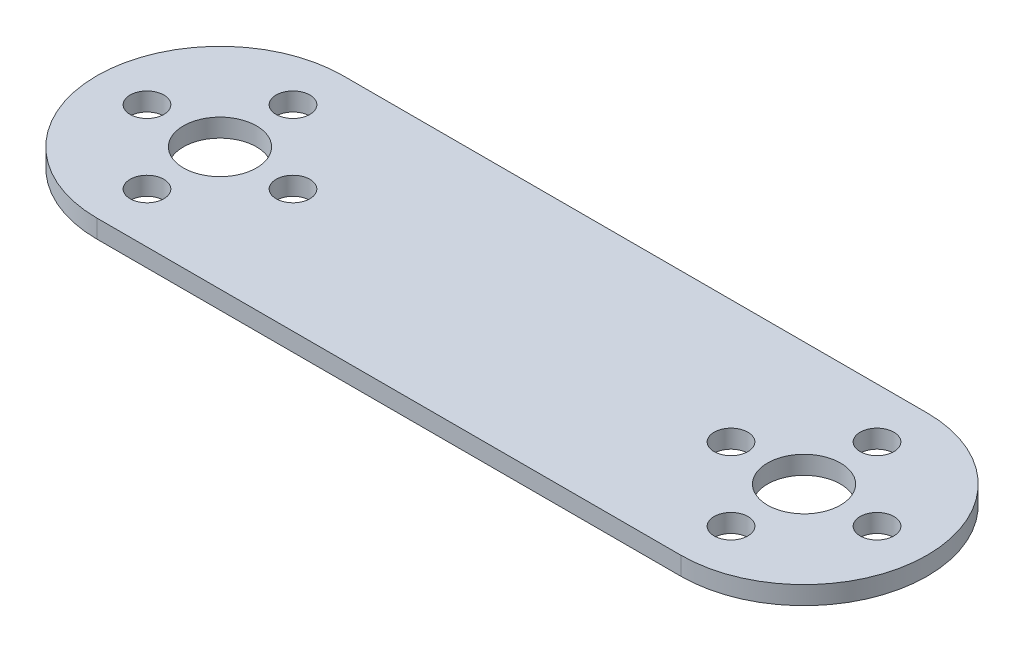
ISO-10303-21;
HEADER;
FILE_DESCRIPTION(('STEP AP214'),'2;1');
FILE_NAME('part.step','',(''),(''),'','','');
FILE_SCHEMA(('AUTOMOTIVE_DESIGN { 1 0 10303 214 1 1 1 1 }'));
ENDSEC;
DATA;
#1=APPLICATION_CONTEXT('core data for automotive mechanical design processes');
#2=APPLICATION_PROTOCOL_DEFINITION('international standard','automotive_design',2000,#1);
#3=PRODUCT_CONTEXT('',#1,'mechanical');
#4=PRODUCT('Part','Part','',(#3));
#5=PRODUCT_RELATED_PRODUCT_CATEGORY('part','',(#4));
#6=PRODUCT_DEFINITION_FORMATION('','',#4);
#7=PRODUCT_DEFINITION_CONTEXT('part definition',#1,'design');
#8=PRODUCT_DEFINITION('design','',#6,#7);
#9=PRODUCT_DEFINITION_SHAPE('','',#8);
#10=(LENGTH_UNIT() NAMED_UNIT(*) SI_UNIT(.MILLI.,.METRE.));
#11=(NAMED_UNIT(*) PLANE_ANGLE_UNIT() SI_UNIT($,.RADIAN.));
#12=(NAMED_UNIT(*) SI_UNIT($,.STERADIAN.) SOLID_ANGLE_UNIT());
#13=UNCERTAINTY_MEASURE_WITH_UNIT(LENGTH_MEASURE(1.E-05),#10,'distance_accuracy_value','');
#14=(GEOMETRIC_REPRESENTATION_CONTEXT(3) GLOBAL_UNCERTAINTY_ASSIGNED_CONTEXT((#13)) GLOBAL_UNIT_ASSIGNED_CONTEXT((#10,
#11,#12)) REPRESENTATION_CONTEXT('',''));
#15=CARTESIAN_POINT('',(0.,0.,0.));
#16=DIRECTION('',(0.,0.,1.));
#17=DIRECTION('',(1.,0.,0.));
#18=AXIS2_PLACEMENT_3D('',#15,#16,#17);
#19=CARTESIAN_POINT('',(0.,2.,0.));
#20=DIRECTION('',(0.,1.,0.));
#21=DIRECTION('',(0.,0.,1.));
#22=AXIS2_PLACEMENT_3D('',#19,#20,#21);
#23=PLANE('',#22);
#24=CARTESIAN_POINT('',(56.,2.,0.));
#25=DIRECTION('',(0.,1.,0.));
#26=DIRECTION('',(0.,0.,1.));
#27=AXIS2_PLACEMENT_3D('',#24,#25,#26);
#28=CIRCLE('',#27,1.85);
#29=CARTESIAN_POINT('',(56.,2.,1.85));
#30=VERTEX_POINT('',#29);
#31=EDGE_CURVE('E113',#30,#30,#28,.F.);
#32=ORIENTED_EDGE('',*,*,#31,.T.);
#33=EDGE_LOOP('',(#32));
#34=FACE_BOUND('',#33,.T.);
#35=CARTESIAN_POINT('',(64.,2.,8.));
#36=DIRECTION('',(0.,1.,0.));
#37=DIRECTION('',(0.,0.,1.));
#38=AXIS2_PLACEMENT_3D('',#35,#36,#37);
#39=CIRCLE('',#38,1.85);
#40=CARTESIAN_POINT('',(64.,2.,9.85));
#41=VERTEX_POINT('',#40);
#42=EDGE_CURVE('E116',#41,#41,#39,.F.);
#43=ORIENTED_EDGE('',*,*,#42,.T.);
#44=EDGE_LOOP('',(#43));
#45=FACE_BOUND('',#44,.T.);
#46=CARTESIAN_POINT('',(72.,2.,0.));
#47=DIRECTION('',(0.,1.,0.));
#48=DIRECTION('',(0.,0.,1.));
#49=AXIS2_PLACEMENT_3D('',#46,#47,#48);
#50=CIRCLE('',#49,1.85);
#51=CARTESIAN_POINT('',(72.,2.,1.85));
#52=VERTEX_POINT('',#51);
#53=EDGE_CURVE('E119',#52,#52,#50,.F.);
#54=ORIENTED_EDGE('',*,*,#53,.T.);
#55=EDGE_LOOP('',(#54));
#56=FACE_BOUND('',#55,.T.);
#57=CARTESIAN_POINT('',(64.,2.,-8.));
#58=DIRECTION('',(0.,1.,0.));
#59=DIRECTION('',(0.,0.,1.));
#60=AXIS2_PLACEMENT_3D('',#57,#58,#59);
#61=CIRCLE('',#60,1.85);
#62=CARTESIAN_POINT('',(64.,2.,-6.15));
#63=VERTEX_POINT('',#62);
#64=EDGE_CURVE('E122',#63,#63,#61,.F.);
#65=ORIENTED_EDGE('',*,*,#64,.T.);
#66=EDGE_LOOP('',(#65));
#67=FACE_BOUND('',#66,.T.);
#68=CARTESIAN_POINT('',(64.,2.,0.));
#69=DIRECTION('',(0.,1.,0.));
#70=DIRECTION('',(0.,0.,1.));
#71=AXIS2_PLACEMENT_3D('',#68,#69,#70);
#72=CIRCLE('',#71,4.);
#73=CARTESIAN_POINT('',(64.,2.,4.));
#74=VERTEX_POINT('',#73);
#75=EDGE_CURVE('E125',#74,#74,#72,.F.);
#76=ORIENTED_EDGE('',*,*,#75,.T.);
#77=EDGE_LOOP('',(#76));
#78=FACE_BOUND('',#77,.T.);
#79=CARTESIAN_POINT('',(-8.,2.,0.));
#80=DIRECTION('',(0.,1.,0.));
#81=DIRECTION('',(0.,0.,1.));
#82=AXIS2_PLACEMENT_3D('',#79,#80,#81);
#83=CIRCLE('',#82,1.85);
#84=CARTESIAN_POINT('',(-8.,2.,1.85));
#85=VERTEX_POINT('',#84);
#86=EDGE_CURVE('E128',#85,#85,#83,.F.);
#87=ORIENTED_EDGE('',*,*,#86,.T.);
#88=EDGE_LOOP('',(#87));
#89=FACE_BOUND('',#88,.T.);
#90=CARTESIAN_POINT('',(0.,2.,8.));
#91=DIRECTION('',(0.,1.,0.));
#92=DIRECTION('',(0.,0.,1.));
#93=AXIS2_PLACEMENT_3D('',#90,#91,#92);
#94=CIRCLE('',#93,1.85);
#95=CARTESIAN_POINT('',(0.,2.,9.85));
#96=VERTEX_POINT('',#95);
#97=EDGE_CURVE('E131',#96,#96,#94,.F.);
#98=ORIENTED_EDGE('',*,*,#97,.T.);
#99=EDGE_LOOP('',(#98));
#100=FACE_BOUND('',#99,.T.);
#101=CARTESIAN_POINT('',(8.,2.,0.));
#102=DIRECTION('',(0.,1.,0.));
#103=DIRECTION('',(0.,0.,1.));
#104=AXIS2_PLACEMENT_3D('',#101,#102,#103);
#105=CIRCLE('',#104,1.85);
#106=CARTESIAN_POINT('',(8.,2.,1.85));
#107=VERTEX_POINT('',#106);
#108=EDGE_CURVE('E134',#107,#107,#105,.F.);
#109=ORIENTED_EDGE('',*,*,#108,.T.);
#110=EDGE_LOOP('',(#109));
#111=FACE_BOUND('',#110,.T.);
#112=CARTESIAN_POINT('',(0.,2.,-8.));
#113=DIRECTION('',(0.,1.,0.));
#114=DIRECTION('',(0.,0.,1.));
#115=AXIS2_PLACEMENT_3D('',#112,#113,#114);
#116=CIRCLE('',#115,1.85);
#117=CARTESIAN_POINT('',(0.,2.,-6.15));
#118=VERTEX_POINT('',#117);
#119=EDGE_CURVE('E137',#118,#118,#116,.F.);
#120=ORIENTED_EDGE('',*,*,#119,.T.);
#121=EDGE_LOOP('',(#120));
#122=FACE_BOUND('',#121,.T.);
#123=CARTESIAN_POINT('',(0.,2.,0.));
#124=DIRECTION('',(0.,1.,0.));
#125=DIRECTION('',(0.,0.,1.));
#126=AXIS2_PLACEMENT_3D('',#123,#124,#125);
#127=CIRCLE('',#126,4.);
#128=CARTESIAN_POINT('',(0.,2.,4.));
#129=VERTEX_POINT('',#128);
#130=EDGE_CURVE('E140',#129,#129,#127,.F.);
#131=ORIENTED_EDGE('',*,*,#130,.T.);
#132=EDGE_LOOP('',(#131));
#133=FACE_BOUND('',#132,.T.);
#134=CARTESIAN_POINT('',(64.,2.,0.));
#135=DIRECTION('',(0.,1.,0.));
#136=DIRECTION('',(0.,0.,1.));
#137=AXIS2_PLACEMENT_3D('',#134,#135,#136);
#138=CIRCLE('',#137,13.5);
#139=CARTESIAN_POINT('',(64.,2.,-13.5));
#140=VERTEX_POINT('',#139);
#141=CARTESIAN_POINT('',(64.,2.,13.5));
#142=VERTEX_POINT('',#141);
#143=EDGE_CURVE('E20',#140,#142,#138,.F.);
#144=ORIENTED_EDGE('',*,*,#143,.F.);
#145=DIRECTION('',(-1.,0.,0.));
#146=VECTOR('',#145,1.);
#147=CARTESIAN_POINT('',(64.,2.,-13.5));
#148=LINE('',#147,#146);
#149=CARTESIAN_POINT('',(0.,2.,-13.5));
#150=VERTEX_POINT('',#149);
#151=EDGE_CURVE('E54',#150,#140,#148,.F.);
#152=ORIENTED_EDGE('',*,*,#151,.F.);
#153=CARTESIAN_POINT('',(0.,2.,0.));
#154=DIRECTION('',(0.,1.,0.));
#155=DIRECTION('',(0.,0.,1.));
#156=AXIS2_PLACEMENT_3D('',#153,#154,#155);
#157=CIRCLE('',#156,13.5);
#158=CARTESIAN_POINT('',(0.,2.,13.5));
#159=VERTEX_POINT('',#158);
#160=EDGE_CURVE('E69',#159,#150,#157,.F.);
#161=ORIENTED_EDGE('',*,*,#160,.F.);
#162=DIRECTION('',(1.,0.,0.));
#163=VECTOR('',#162,1.);
#164=CARTESIAN_POINT('',(0.,2.,13.5));
#165=LINE('',#164,#163);
#166=EDGE_CURVE('E67',#142,#159,#165,.F.);
#167=ORIENTED_EDGE('',*,*,#166,.F.);
#168=EDGE_LOOP('',(#144,#152,#161,#167));
#169=FACE_BOUND('',#168,.T.);
#170=ADVANCED_FACE('F17',(#34,#45,#56,#67,#78,#89,#100,#111,#122,#133,#169),#23,.T.);
#171=CARTESIAN_POINT('',(0.,0.,13.5));
#172=DIRECTION('',(0.,0.,1.));
#173=DIRECTION('',(1.,0.,0.));
#174=AXIS2_PLACEMENT_3D('',#171,#172,#173);
#175=PLANE('',#174);
#176=ORIENTED_EDGE('',*,*,#166,.T.);
#177=DIRECTION('',(0.,1.,0.));
#178=VECTOR('',#177,1.);
#179=CARTESIAN_POINT('',(0.,0.,13.5));
#180=LINE('',#179,#178);
#181=CARTESIAN_POINT('',(0.,0.,13.5));
#182=VERTEX_POINT('',#181);
#183=EDGE_CURVE('E142',#182,#159,#180,.T.);
#184=ORIENTED_EDGE('',*,*,#183,.F.);
#185=DIRECTION('',(1.,0.,0.));
#186=VECTOR('',#185,1.);
#187=CARTESIAN_POINT('',(0.,0.,13.5));
#188=LINE('',#187,#186);
#189=CARTESIAN_POINT('',(64.,0.,13.5));
#190=VERTEX_POINT('',#189);
#191=EDGE_CURVE('E76',#182,#190,#188,.T.);
#192=ORIENTED_EDGE('',*,*,#191,.T.);
#193=DIRECTION('',(0.,1.,0.));
#194=VECTOR('',#193,1.);
#195=CARTESIAN_POINT('',(64.,0.,13.5));
#196=LINE('',#195,#194);
#197=EDGE_CURVE('E63',#142,#190,#196,.F.);
#198=ORIENTED_EDGE('',*,*,#197,.F.);
#199=EDGE_LOOP('',(#176,#184,#192,#198));
#200=FACE_BOUND('',#199,.T.);
#201=ADVANCED_FACE('F75',(#200),#175,.T.);
#202=CARTESIAN_POINT('',(64.,0.,0.));
#203=DIRECTION('',(0.,1.,0.));
#204=DIRECTION('',(0.,0.,1.));
#205=AXIS2_PLACEMENT_3D('',#202,#203,#204);
#206=CYLINDRICAL_SURFACE('',#205,13.5);
#207=ORIENTED_EDGE('',*,*,#143,.T.);
#208=ORIENTED_EDGE('',*,*,#197,.T.);
#209=CARTESIAN_POINT('',(64.,0.,0.));
#210=DIRECTION('',(0.,1.,0.));
#211=DIRECTION('',(0.,0.,1.));
#212=AXIS2_PLACEMENT_3D('',#209,#210,#211);
#213=CIRCLE('',#212,13.5);
#214=CARTESIAN_POINT('',(64.,0.,-13.5));
#215=VERTEX_POINT('',#214);
#216=EDGE_CURVE('E111',#190,#215,#213,.T.);
#217=ORIENTED_EDGE('',*,*,#216,.T.);
#218=DIRECTION('',(0.,1.,0.));
#219=VECTOR('',#218,1.);
#220=CARTESIAN_POINT('',(64.,0.,-13.5));
#221=LINE('',#220,#219);
#222=EDGE_CURVE('E65',#140,#215,#221,.F.);
#223=ORIENTED_EDGE('',*,*,#222,.F.);
#224=EDGE_LOOP('',(#207,#208,#217,#223));
#225=FACE_BOUND('',#224,.T.);
#226=ADVANCED_FACE('F60',(#225),#206,.T.);
#227=CARTESIAN_POINT('',(64.,0.,-13.5));
#228=DIRECTION('',(0.,0.,-1.));
#229=DIRECTION('',(-1.,0.,0.));
#230=AXIS2_PLACEMENT_3D('',#227,#228,#229);
#231=PLANE('',#230);
#232=ORIENTED_EDGE('',*,*,#151,.T.);
#233=ORIENTED_EDGE('',*,*,#222,.T.);
#234=DIRECTION('',(1.,0.,0.));
#235=VECTOR('',#234,1.);
#236=CARTESIAN_POINT('',(0.,0.,-13.5));
#237=LINE('',#236,#235);
#238=CARTESIAN_POINT('',(0.,0.,-13.5));
#239=VERTEX_POINT('',#238);
#240=EDGE_CURVE('E110',#215,#239,#237,.F.);
#241=ORIENTED_EDGE('',*,*,#240,.T.);
#242=DIRECTION('',(0.,1.,0.));
#243=VECTOR('',#242,1.);
#244=CARTESIAN_POINT('',(0.,0.,-13.5));
#245=LINE('',#244,#243);
#246=EDGE_CURVE('E35',#150,#239,#245,.F.);
#247=ORIENTED_EDGE('',*,*,#246,.F.);
#248=EDGE_LOOP('',(#232,#233,#241,#247));
#249=FACE_BOUND('',#248,.T.);
#250=ADVANCED_FACE('F148',(#249),#231,.T.);
#251=CARTESIAN_POINT('',(0.,0.,0.));
#252=DIRECTION('',(0.,1.,0.));
#253=DIRECTION('',(0.,0.,1.));
#254=AXIS2_PLACEMENT_3D('',#251,#252,#253);
#255=CYLINDRICAL_SURFACE('',#254,13.5);
#256=ORIENTED_EDGE('',*,*,#160,.T.);
#257=ORIENTED_EDGE('',*,*,#246,.T.);
#258=CARTESIAN_POINT('',(0.,0.,0.));
#259=DIRECTION('',(0.,1.,0.));
#260=DIRECTION('',(0.,0.,1.));
#261=AXIS2_PLACEMENT_3D('',#258,#259,#260);
#262=CIRCLE('',#261,13.5);
#263=EDGE_CURVE('E108',#239,#182,#262,.T.);
#264=ORIENTED_EDGE('',*,*,#263,.T.);
#265=ORIENTED_EDGE('',*,*,#183,.T.);
#266=EDGE_LOOP('',(#256,#257,#264,#265));
#267=FACE_BOUND('',#266,.T.);
#268=ADVANCED_FACE('F151',(#267),#255,.T.);
#269=CARTESIAN_POINT('',(0.,0.,0.));
#270=DIRECTION('',(0.,1.,0.));
#271=DIRECTION('',(0.,0.,1.));
#272=AXIS2_PLACEMENT_3D('',#269,#270,#271);
#273=CYLINDRICAL_SURFACE('',#272,4.);
#274=CARTESIAN_POINT('',(0.,0.,0.));
#275=DIRECTION('',(0.,1.,0.));
#276=DIRECTION('',(0.,0.,1.));
#277=AXIS2_PLACEMENT_3D('',#274,#275,#276);
#278=CIRCLE('',#277,4.);
#279=CARTESIAN_POINT('',(0.,0.,4.));
#280=VERTEX_POINT('',#279);
#281=EDGE_CURVE('E105',#280,#280,#278,.F.);
#282=ORIENTED_EDGE('',*,*,#281,.T.);
#283=EDGE_LOOP('',(#282));
#284=FACE_BOUND('',#283,.T.);
#285=ORIENTED_EDGE('',*,*,#130,.F.);
#286=EDGE_LOOP('',(#285));
#287=FACE_BOUND('',#286,.T.);
#288=ADVANCED_FACE('F153',(#284,#287),#273,.F.);
#289=CARTESIAN_POINT('',(0.,0.,-8.));
#290=DIRECTION('',(0.,1.,0.));
#291=DIRECTION('',(0.,0.,1.));
#292=AXIS2_PLACEMENT_3D('',#289,#290,#291);
#293=CYLINDRICAL_SURFACE('',#292,1.85);
#294=CARTESIAN_POINT('',(0.,0.,-8.));
#295=DIRECTION('',(0.,1.,0.));
#296=DIRECTION('',(0.,0.,1.));
#297=AXIS2_PLACEMENT_3D('',#294,#295,#296);
#298=CIRCLE('',#297,1.85);
#299=CARTESIAN_POINT('',(0.,0.,-6.15));
#300=VERTEX_POINT('',#299);
#301=EDGE_CURVE('E102',#300,#300,#298,.F.);
#302=ORIENTED_EDGE('',*,*,#301,.T.);
#303=EDGE_LOOP('',(#302));
#304=FACE_BOUND('',#303,.T.);
#305=ORIENTED_EDGE('',*,*,#119,.F.);
#306=EDGE_LOOP('',(#305));
#307=FACE_BOUND('',#306,.T.);
#308=ADVANCED_FACE('F160',(#304,#307),#293,.F.);
#309=CARTESIAN_POINT('',(8.,0.,0.));
#310=DIRECTION('',(0.,1.,0.));
#311=DIRECTION('',(0.,0.,1.));
#312=AXIS2_PLACEMENT_3D('',#309,#310,#311);
#313=CYLINDRICAL_SURFACE('',#312,1.85);
#314=CARTESIAN_POINT('',(8.,0.,0.));
#315=DIRECTION('',(0.,1.,0.));
#316=DIRECTION('',(0.,0.,1.));
#317=AXIS2_PLACEMENT_3D('',#314,#315,#316);
#318=CIRCLE('',#317,1.85);
#319=CARTESIAN_POINT('',(8.,0.,1.85));
#320=VERTEX_POINT('',#319);
#321=EDGE_CURVE('E99',#320,#320,#318,.F.);
#322=ORIENTED_EDGE('',*,*,#321,.T.);
#323=EDGE_LOOP('',(#322));
#324=FACE_BOUND('',#323,.T.);
#325=ORIENTED_EDGE('',*,*,#108,.F.);
#326=EDGE_LOOP('',(#325));
#327=FACE_BOUND('',#326,.T.);
#328=ADVANCED_FACE('F199',(#324,#327),#313,.F.);
#329=CARTESIAN_POINT('',(0.,0.,8.));
#330=DIRECTION('',(0.,1.,0.));
#331=DIRECTION('',(0.,0.,1.));
#332=AXIS2_PLACEMENT_3D('',#329,#330,#331);
#333=CYLINDRICAL_SURFACE('',#332,1.85);
#334=CARTESIAN_POINT('',(0.,0.,8.));
#335=DIRECTION('',(0.,1.,0.));
#336=DIRECTION('',(0.,0.,1.));
#337=AXIS2_PLACEMENT_3D('',#334,#335,#336);
#338=CIRCLE('',#337,1.85);
#339=CARTESIAN_POINT('',(0.,0.,9.85));
#340=VERTEX_POINT('',#339);
#341=EDGE_CURVE('E96',#340,#340,#338,.F.);
#342=ORIENTED_EDGE('',*,*,#341,.T.);
#343=EDGE_LOOP('',(#342));
#344=FACE_BOUND('',#343,.T.);
#345=ORIENTED_EDGE('',*,*,#97,.F.);
#346=EDGE_LOOP('',(#345));
#347=FACE_BOUND('',#346,.T.);
#348=ADVANCED_FACE('F195',(#344,#347),#333,.F.);
#349=CARTESIAN_POINT('',(-8.,0.,0.));
#350=DIRECTION('',(0.,1.,0.));
#351=DIRECTION('',(0.,0.,1.));
#352=AXIS2_PLACEMENT_3D('',#349,#350,#351);
#353=CYLINDRICAL_SURFACE('',#352,1.85);
#354=CARTESIAN_POINT('',(-8.,0.,0.));
#355=DIRECTION('',(0.,1.,0.));
#356=DIRECTION('',(0.,0.,1.));
#357=AXIS2_PLACEMENT_3D('',#354,#355,#356);
#358=CIRCLE('',#357,1.85);
#359=CARTESIAN_POINT('',(-8.,0.,1.85));
#360=VERTEX_POINT('',#359);
#361=EDGE_CURVE('E93',#360,#360,#358,.F.);
#362=ORIENTED_EDGE('',*,*,#361,.T.);
#363=EDGE_LOOP('',(#362));
#364=FACE_BOUND('',#363,.T.);
#365=ORIENTED_EDGE('',*,*,#86,.F.);
#366=EDGE_LOOP('',(#365));
#367=FACE_BOUND('',#366,.T.);
#368=ADVANCED_FACE('F191',(#364,#367),#353,.F.);
#369=CARTESIAN_POINT('',(64.,0.,0.));
#370=DIRECTION('',(0.,1.,0.));
#371=DIRECTION('',(0.,0.,1.));
#372=AXIS2_PLACEMENT_3D('',#369,#370,#371);
#373=CYLINDRICAL_SURFACE('',#372,4.);
#374=ORIENTED_EDGE('',*,*,#75,.F.);
#375=EDGE_LOOP('',(#374));
#376=FACE_BOUND('',#375,.T.);
#377=CARTESIAN_POINT('',(64.,0.,0.));
#378=DIRECTION('',(0.,1.,0.));
#379=DIRECTION('',(0.,0.,1.));
#380=AXIS2_PLACEMENT_3D('',#377,#378,#379);
#381=CIRCLE('',#380,4.);
#382=CARTESIAN_POINT('',(64.,0.,4.));
#383=VERTEX_POINT('',#382);
#384=EDGE_CURVE('E90',#383,#383,#381,.F.);
#385=ORIENTED_EDGE('',*,*,#384,.T.);
#386=EDGE_LOOP('',(#385));
#387=FACE_BOUND('',#386,.T.);
#388=ADVANCED_FACE('F187',(#376,#387),#373,.F.);
#389=CARTESIAN_POINT('',(64.,0.,-8.));
#390=DIRECTION('',(0.,1.,0.));
#391=DIRECTION('',(0.,0.,1.));
#392=AXIS2_PLACEMENT_3D('',#389,#390,#391);
#393=CYLINDRICAL_SURFACE('',#392,1.85);
#394=ORIENTED_EDGE('',*,*,#64,.F.);
#395=EDGE_LOOP('',(#394));
#396=FACE_BOUND('',#395,.T.);
#397=CARTESIAN_POINT('',(64.,0.,-8.));
#398=DIRECTION('',(0.,1.,0.));
#399=DIRECTION('',(0.,0.,1.));
#400=AXIS2_PLACEMENT_3D('',#397,#398,#399);
#401=CIRCLE('',#400,1.85);
#402=CARTESIAN_POINT('',(64.,0.,-6.15));
#403=VERTEX_POINT('',#402);
#404=EDGE_CURVE('E87',#403,#403,#401,.F.);
#405=ORIENTED_EDGE('',*,*,#404,.T.);
#406=EDGE_LOOP('',(#405));
#407=FACE_BOUND('',#406,.T.);
#408=ADVANCED_FACE('F183',(#396,#407),#393,.F.);
#409=CARTESIAN_POINT('',(72.,0.,0.));
#410=DIRECTION('',(0.,1.,0.));
#411=DIRECTION('',(0.,0.,1.));
#412=AXIS2_PLACEMENT_3D('',#409,#410,#411);
#413=CYLINDRICAL_SURFACE('',#412,1.85);
#414=ORIENTED_EDGE('',*,*,#53,.F.);
#415=EDGE_LOOP('',(#414));
#416=FACE_BOUND('',#415,.T.);
#417=CARTESIAN_POINT('',(72.,0.,0.));
#418=DIRECTION('',(0.,1.,0.));
#419=DIRECTION('',(0.,0.,1.));
#420=AXIS2_PLACEMENT_3D('',#417,#418,#419);
#421=CIRCLE('',#420,1.85);
#422=CARTESIAN_POINT('',(72.,0.,1.85));
#423=VERTEX_POINT('',#422);
#424=EDGE_CURVE('E84',#423,#423,#421,.F.);
#425=ORIENTED_EDGE('',*,*,#424,.T.);
#426=EDGE_LOOP('',(#425));
#427=FACE_BOUND('',#426,.T.);
#428=ADVANCED_FACE('F179',(#416,#427),#413,.F.);
#429=CARTESIAN_POINT('',(64.,0.,8.));
#430=DIRECTION('',(0.,1.,0.));
#431=DIRECTION('',(0.,0.,1.));
#432=AXIS2_PLACEMENT_3D('',#429,#430,#431);
#433=CYLINDRICAL_SURFACE('',#432,1.85);
#434=ORIENTED_EDGE('',*,*,#42,.F.);
#435=EDGE_LOOP('',(#434));
#436=FACE_BOUND('',#435,.T.);
#437=CARTESIAN_POINT('',(64.,0.,8.));
#438=DIRECTION('',(0.,1.,0.));
#439=DIRECTION('',(0.,0.,1.));
#440=AXIS2_PLACEMENT_3D('',#437,#438,#439);
#441=CIRCLE('',#440,1.85);
#442=CARTESIAN_POINT('',(64.,0.,9.85));
#443=VERTEX_POINT('',#442);
#444=EDGE_CURVE('E26',#443,#443,#441,.F.);
#445=ORIENTED_EDGE('',*,*,#444,.T.);
#446=EDGE_LOOP('',(#445));
#447=FACE_BOUND('',#446,.T.);
#448=ADVANCED_FACE('F171',(#436,#447),#433,.F.);
#449=CARTESIAN_POINT('',(56.,0.,0.));
#450=DIRECTION('',(0.,1.,0.));
#451=DIRECTION('',(0.,0.,1.));
#452=AXIS2_PLACEMENT_3D('',#449,#450,#451);
#453=CYLINDRICAL_SURFACE('',#452,1.85);
#454=ORIENTED_EDGE('',*,*,#31,.F.);
#455=EDGE_LOOP('',(#454));
#456=FACE_BOUND('',#455,.T.);
#457=CARTESIAN_POINT('',(56.,0.,0.));
#458=DIRECTION('',(0.,1.,0.));
#459=DIRECTION('',(0.,0.,1.));
#460=AXIS2_PLACEMENT_3D('',#457,#458,#459);
#461=CIRCLE('',#460,1.85);
#462=CARTESIAN_POINT('',(56.,0.,1.85));
#463=VERTEX_POINT('',#462);
#464=EDGE_CURVE('E10',#463,#463,#461,.F.);
#465=ORIENTED_EDGE('',*,*,#464,.T.);
#466=EDGE_LOOP('',(#465));
#467=FACE_BOUND('',#466,.T.);
#468=ADVANCED_FACE('F165',(#456,#467),#453,.F.);
#469=CARTESIAN_POINT('',(0.,0.,0.));
#470=DIRECTION('',(0.,1.,0.));
#471=DIRECTION('',(0.,0.,1.));
#472=AXIS2_PLACEMENT_3D('',#469,#470,#471);
#473=PLANE('',#472);
#474=ORIENTED_EDGE('',*,*,#464,.F.);
#475=EDGE_LOOP('',(#474));
#476=FACE_BOUND('',#475,.T.);
#477=ORIENTED_EDGE('',*,*,#444,.F.);
#478=EDGE_LOOP('',(#477));
#479=FACE_BOUND('',#478,.T.);
#480=ORIENTED_EDGE('',*,*,#424,.F.);
#481=EDGE_LOOP('',(#480));
#482=FACE_BOUND('',#481,.T.);
#483=ORIENTED_EDGE('',*,*,#404,.F.);
#484=EDGE_LOOP('',(#483));
#485=FACE_BOUND('',#484,.T.);
#486=ORIENTED_EDGE('',*,*,#384,.F.);
#487=EDGE_LOOP('',(#486));
#488=FACE_BOUND('',#487,.T.);
#489=ORIENTED_EDGE('',*,*,#361,.F.);
#490=EDGE_LOOP('',(#489));
#491=FACE_BOUND('',#490,.T.);
#492=ORIENTED_EDGE('',*,*,#341,.F.);
#493=EDGE_LOOP('',(#492));
#494=FACE_BOUND('',#493,.T.);
#495=ORIENTED_EDGE('',*,*,#321,.F.);
#496=EDGE_LOOP('',(#495));
#497=FACE_BOUND('',#496,.T.);
#498=ORIENTED_EDGE('',*,*,#301,.F.);
#499=EDGE_LOOP('',(#498));
#500=FACE_BOUND('',#499,.T.);
#501=ORIENTED_EDGE('',*,*,#281,.F.);
#502=EDGE_LOOP('',(#501));
#503=FACE_BOUND('',#502,.T.);
#504=ORIENTED_EDGE('',*,*,#240,.F.);
#505=ORIENTED_EDGE('',*,*,#216,.F.);
#506=ORIENTED_EDGE('',*,*,#191,.F.);
#507=ORIENTED_EDGE('',*,*,#263,.F.);
#508=EDGE_LOOP('',(#504,#505,#506,#507));
#509=FACE_BOUND('',#508,.T.);
#510=ADVANCED_FACE('F150',(#476,#479,#482,#485,#488,#491,#494,#497,#500,#503,#509),#473,.F.);
#511=CLOSED_SHELL('',(#170,#201,#226,#250,#268,#288,#308,#328,#348,#368,#388,#408,#428,#448,
#468,#510));
#512=MANIFOLD_SOLID_BREP('B1',#511);
#513=ADVANCED_BREP_SHAPE_REPRESENTATION('',(#18,#512),#14);
#514=SHAPE_DEFINITION_REPRESENTATION(#9,#513);
ENDSEC;
END-ISO-10303-21;
